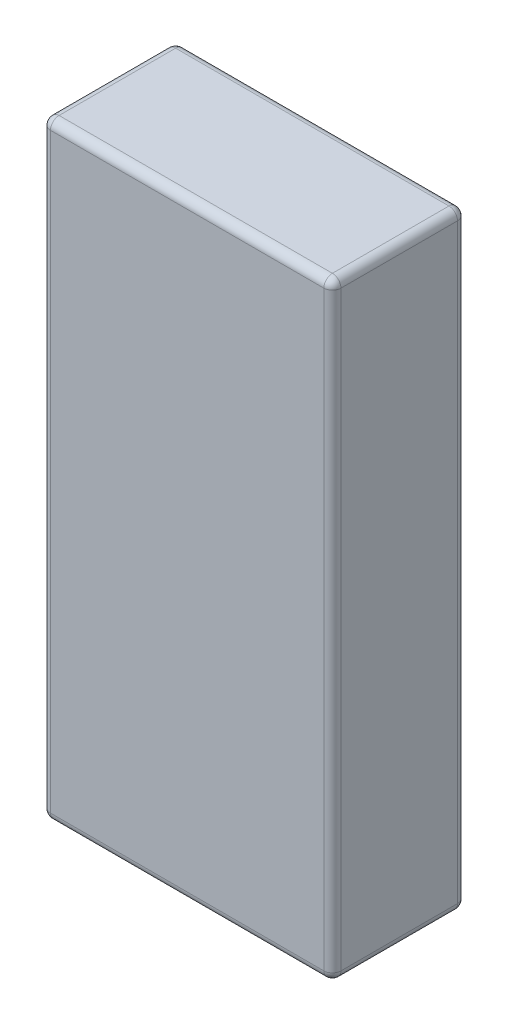
ISO-10303-21;
HEADER;
FILE_DESCRIPTION(('STEP AP214'),'2;1');
FILE_NAME('part.step','',(''),(''),'','','');
FILE_SCHEMA(('AUTOMOTIVE_DESIGN { 1 0 10303 214 1 1 1 1 }'));
ENDSEC;
DATA;
#1=APPLICATION_CONTEXT('core data for automotive mechanical design processes');
#2=APPLICATION_PROTOCOL_DEFINITION('international standard','automotive_design',2000,#1);
#3=PRODUCT_CONTEXT('',#1,'mechanical');
#4=PRODUCT('Part','Part','',(#3));
#5=PRODUCT_RELATED_PRODUCT_CATEGORY('part','',(#4));
#6=PRODUCT_DEFINITION_FORMATION('','',#4);
#7=PRODUCT_DEFINITION_CONTEXT('part definition',#1,'design');
#8=PRODUCT_DEFINITION('design','',#6,#7);
#9=PRODUCT_DEFINITION_SHAPE('','',#8);
#10=(LENGTH_UNIT() NAMED_UNIT(*) SI_UNIT(.MILLI.,.METRE.));
#11=(NAMED_UNIT(*) PLANE_ANGLE_UNIT() SI_UNIT($,.RADIAN.));
#12=(NAMED_UNIT(*) SI_UNIT($,.STERADIAN.) SOLID_ANGLE_UNIT());
#13=UNCERTAINTY_MEASURE_WITH_UNIT(LENGTH_MEASURE(1.E-05),#10,'distance_accuracy_value','');
#14=(GEOMETRIC_REPRESENTATION_CONTEXT(3) GLOBAL_UNCERTAINTY_ASSIGNED_CONTEXT((#13)) GLOBAL_UNIT_ASSIGNED_CONTEXT((#10,
#11,#12)) REPRESENTATION_CONTEXT('',''));
#15=CARTESIAN_POINT('',(0.,0.,0.));
#16=DIRECTION('',(0.,0.,1.));
#17=DIRECTION('',(1.,0.,0.));
#18=AXIS2_PLACEMENT_3D('',#15,#16,#17);
#19=CARTESIAN_POINT('',(16.95,-35.5,7.8));
#20=DIRECTION('',(-1.,0.,0.));
#21=DIRECTION('',(0.,0.,1.));
#22=AXIS2_PLACEMENT_3D('',#19,#20,#21);
#23=PLANE('',#22);
#24=DIRECTION('',(0.,0.,-1.));
#25=VECTOR('',#24,1.);
#26=CARTESIAN_POINT('',(16.95,34.5,7.8));
#27=LINE('',#26,#25);
#28=CARTESIAN_POINT('',(16.95,34.5,-6.8));
#29=VERTEX_POINT('',#28);
#30=CARTESIAN_POINT('',(16.95,34.5,6.8));
#31=VERTEX_POINT('',#30);
#32=EDGE_CURVE('E49',#29,#31,#27,.F.);
#33=ORIENTED_EDGE('',*,*,#32,.T.);
#34=DIRECTION('',(0.,1.,0.));
#35=VECTOR('',#34,1.);
#36=CARTESIAN_POINT('',(16.95,-35.5,6.8));
#37=LINE('',#36,#35);
#38=CARTESIAN_POINT('',(16.95,-34.5,6.8));
#39=VERTEX_POINT('',#38);
#40=EDGE_CURVE('E11',#31,#39,#37,.F.);
#41=ORIENTED_EDGE('',*,*,#40,.T.);
#42=DIRECTION('',(0.,0.,-1.));
#43=VECTOR('',#42,1.);
#44=CARTESIAN_POINT('',(16.95,-34.5,7.8));
#45=LINE('',#44,#43);
#46=CARTESIAN_POINT('',(16.95,-34.5,-6.8));
#47=VERTEX_POINT('',#46);
#48=EDGE_CURVE('E218',#39,#47,#45,.T.);
#49=ORIENTED_EDGE('',*,*,#48,.T.);
#50=DIRECTION('',(0.,1.,0.));
#51=VECTOR('',#50,1.);
#52=CARTESIAN_POINT('',(16.95,34.5,-6.8));
#53=LINE('',#52,#51);
#54=EDGE_CURVE('E60',#47,#29,#53,.T.);
#55=ORIENTED_EDGE('',*,*,#54,.T.);
#56=EDGE_LOOP('',(#33,#41,#49,#55));
#57=FACE_BOUND('',#56,.T.);
#58=ADVANCED_FACE('F40',(#57),#23,.F.);
#59=CARTESIAN_POINT('',(-16.95,35.5,7.8));
#60=DIRECTION('',(0.,-1.,0.));
#61=DIRECTION('',(0.,0.,-1.));
#62=AXIS2_PLACEMENT_3D('',#59,#60,#61);
#63=PLANE('',#62);
#64=DIRECTION('',(-1.,0.,0.));
#65=VECTOR('',#64,1.);
#66=CARTESIAN_POINT('',(-16.95,35.5,-6.8));
#67=LINE('',#66,#65);
#68=CARTESIAN_POINT('',(15.95,35.5,-6.8));
#69=VERTEX_POINT('',#68);
#70=CARTESIAN_POINT('',(-15.95,35.5,-6.8));
#71=VERTEX_POINT('',#70);
#72=EDGE_CURVE('E136',#69,#71,#67,.T.);
#73=ORIENTED_EDGE('',*,*,#72,.T.);
#74=DIRECTION('',(0.,0.,-1.));
#75=VECTOR('',#74,1.);
#76=CARTESIAN_POINT('',(-15.95,35.5,7.8));
#77=LINE('',#76,#75);
#78=CARTESIAN_POINT('',(-15.95,35.5,6.8));
#79=VERTEX_POINT('',#78);
#80=EDGE_CURVE('E130',#71,#79,#77,.F.);
#81=ORIENTED_EDGE('',*,*,#80,.T.);
#82=DIRECTION('',(-1.,0.,0.));
#83=VECTOR('',#82,1.);
#84=CARTESIAN_POINT('',(-16.95,35.5,6.8));
#85=LINE('',#84,#83);
#86=CARTESIAN_POINT('',(15.95,35.5,6.8));
#87=VERTEX_POINT('',#86);
#88=EDGE_CURVE('E133',#79,#87,#85,.F.);
#89=ORIENTED_EDGE('',*,*,#88,.T.);
#90=DIRECTION('',(0.,0.,-1.));
#91=VECTOR('',#90,1.);
#92=CARTESIAN_POINT('',(15.95,35.5,7.8));
#93=LINE('',#92,#91);
#94=EDGE_CURVE('E141',#87,#69,#93,.T.);
#95=ORIENTED_EDGE('',*,*,#94,.T.);
#96=EDGE_LOOP('',(#73,#81,#89,#95));
#97=FACE_BOUND('',#96,.T.);
#98=ADVANCED_FACE('F132',(#97),#63,.F.);
#99=CARTESIAN_POINT('',(-16.95,-35.5,7.8));
#100=DIRECTION('',(1.,0.,0.));
#101=DIRECTION('',(0.,0.,-1.));
#102=AXIS2_PLACEMENT_3D('',#99,#100,#101);
#103=PLANE('',#102);
#104=DIRECTION('',(0.,-1.,0.));
#105=VECTOR('',#104,1.);
#106=CARTESIAN_POINT('',(-16.95,-35.5,6.8));
#107=LINE('',#106,#105);
#108=CARTESIAN_POINT('',(-16.95,-34.5,6.8));
#109=VERTEX_POINT('',#108);
#110=CARTESIAN_POINT('',(-16.95,34.5,6.8));
#111=VERTEX_POINT('',#110);
#112=EDGE_CURVE('E161',#109,#111,#107,.F.);
#113=ORIENTED_EDGE('',*,*,#112,.T.);
#114=DIRECTION('',(0.,0.,-1.));
#115=VECTOR('',#114,1.);
#116=CARTESIAN_POINT('',(-16.95,34.5,7.8));
#117=LINE('',#116,#115);
#118=CARTESIAN_POINT('',(-16.95,34.5,-6.8));
#119=VERTEX_POINT('',#118);
#120=EDGE_CURVE('E166',#111,#119,#117,.T.);
#121=ORIENTED_EDGE('',*,*,#120,.T.);
#122=DIRECTION('',(0.,-1.,0.));
#123=VECTOR('',#122,1.);
#124=CARTESIAN_POINT('',(-16.95,-34.5,-6.8));
#125=LINE('',#124,#123);
#126=CARTESIAN_POINT('',(-16.95,-34.5,-6.8));
#127=VERTEX_POINT('',#126);
#128=EDGE_CURVE('E247',#119,#127,#125,.T.);
#129=ORIENTED_EDGE('',*,*,#128,.T.);
#130=DIRECTION('',(0.,0.,-1.));
#131=VECTOR('',#130,1.);
#132=CARTESIAN_POINT('',(-16.95,-34.5,7.8));
#133=LINE('',#132,#131);
#134=EDGE_CURVE('E249',#127,#109,#133,.F.);
#135=ORIENTED_EDGE('',*,*,#134,.T.);
#136=EDGE_LOOP('',(#113,#121,#129,#135));
#137=FACE_BOUND('',#136,.T.);
#138=ADVANCED_FACE('F293',(#137),#103,.F.);
#139=CARTESIAN_POINT('',(-16.95,-35.5,7.8));
#140=DIRECTION('',(0.,1.,0.));
#141=DIRECTION('',(0.,0.,1.));
#142=AXIS2_PLACEMENT_3D('',#139,#140,#141);
#143=PLANE('',#142);
#144=DIRECTION('',(1.,0.,0.));
#145=VECTOR('',#144,1.);
#146=CARTESIAN_POINT('',(-16.95,-35.5,6.8));
#147=LINE('',#146,#145);
#148=CARTESIAN_POINT('',(15.95,-35.5,6.8));
#149=VERTEX_POINT('',#148);
#150=CARTESIAN_POINT('',(-15.95,-35.5,6.8));
#151=VERTEX_POINT('',#150);
#152=EDGE_CURVE('E190',#149,#151,#147,.F.);
#153=ORIENTED_EDGE('',*,*,#152,.T.);
#154=DIRECTION('',(0.,0.,-1.));
#155=VECTOR('',#154,1.);
#156=CARTESIAN_POINT('',(-15.95,-35.5,7.8));
#157=LINE('',#156,#155);
#158=CARTESIAN_POINT('',(-15.95,-35.5,-6.8));
#159=VERTEX_POINT('',#158);
#160=EDGE_CURVE('E231',#151,#159,#157,.T.);
#161=ORIENTED_EDGE('',*,*,#160,.T.);
#162=DIRECTION('',(1.,0.,0.));
#163=VECTOR('',#162,1.);
#164=CARTESIAN_POINT('',(16.95,-35.5,-6.8));
#165=LINE('',#164,#163);
#166=CARTESIAN_POINT('',(15.95,-35.5,-6.8));
#167=VERTEX_POINT('',#166);
#168=EDGE_CURVE('E265',#159,#167,#165,.T.);
#169=ORIENTED_EDGE('',*,*,#168,.T.);
#170=DIRECTION('',(0.,0.,-1.));
#171=VECTOR('',#170,1.);
#172=CARTESIAN_POINT('',(15.95,-35.5,7.8));
#173=LINE('',#172,#171);
#174=EDGE_CURVE('E233',#167,#149,#173,.F.);
#175=ORIENTED_EDGE('',*,*,#174,.T.);
#176=EDGE_LOOP('',(#153,#161,#169,#175));
#177=FACE_BOUND('',#176,.T.);
#178=ADVANCED_FACE('F275',(#177),#143,.F.);
#179=CARTESIAN_POINT('',(0.,0.,7.8));
#180=DIRECTION('',(0.,0.,-1.));
#181=DIRECTION('',(-1.,0.,0.));
#182=AXIS2_PLACEMENT_3D('',#179,#180,#181);
#183=PLANE('',#182);
#184=DIRECTION('',(1.,0.,0.));
#185=VECTOR('',#184,1.);
#186=CARTESIAN_POINT('',(0.,-34.5,7.8));
#187=LINE('',#186,#185);
#188=CARTESIAN_POINT('',(-15.95,-34.5,7.8));
#189=VERTEX_POINT('',#188);
#190=CARTESIAN_POINT('',(15.95,-34.5,7.8));
#191=VERTEX_POINT('',#190);
#192=EDGE_CURVE('E152',#189,#191,#187,.T.);
#193=ORIENTED_EDGE('',*,*,#192,.T.);
#194=DIRECTION('',(0.,1.,0.));
#195=VECTOR('',#194,1.);
#196=CARTESIAN_POINT('',(15.95,0.,7.8));
#197=LINE('',#196,#195);
#198=CARTESIAN_POINT('',(15.95,34.5,7.8));
#199=VERTEX_POINT('',#198);
#200=EDGE_CURVE('E222',#191,#199,#197,.T.);
#201=ORIENTED_EDGE('',*,*,#200,.T.);
#202=DIRECTION('',(-1.,0.,0.));
#203=VECTOR('',#202,1.);
#204=CARTESIAN_POINT('',(0.,34.5,7.8));
#205=LINE('',#204,#203);
#206=CARTESIAN_POINT('',(-15.95,34.5,7.8));
#207=VERTEX_POINT('',#206);
#208=EDGE_CURVE('E256',#199,#207,#205,.T.);
#209=ORIENTED_EDGE('',*,*,#208,.T.);
#210=DIRECTION('',(0.,-1.,0.));
#211=VECTOR('',#210,1.);
#212=CARTESIAN_POINT('',(-15.95,0.,7.8));
#213=LINE('',#212,#211);
#214=EDGE_CURVE('E224',#207,#189,#213,.T.);
#215=ORIENTED_EDGE('',*,*,#214,.T.);
#216=EDGE_LOOP('',(#193,#201,#209,#215));
#217=FACE_BOUND('',#216,.T.);
#218=ADVANCED_FACE('F504',(#217),#183,.F.);
#219=CARTESIAN_POINT('',(0.,0.,-7.8));
#220=DIRECTION('',(0.,0.,-1.));
#221=DIRECTION('',(-1.,0.,0.));
#222=AXIS2_PLACEMENT_3D('',#219,#220,#221);
#223=PLANE('',#222);
#224=DIRECTION('',(1.,0.,0.));
#225=VECTOR('',#224,1.);
#226=CARTESIAN_POINT('',(-16.95,-34.5,-7.8));
#227=LINE('',#226,#225);
#228=CARTESIAN_POINT('',(15.95,-34.5,-7.8));
#229=VERTEX_POINT('',#228);
#230=CARTESIAN_POINT('',(-15.95,-34.5,-7.8));
#231=VERTEX_POINT('',#230);
#232=EDGE_CURVE('E258',#229,#231,#227,.F.);
#233=ORIENTED_EDGE('',*,*,#232,.T.);
#234=DIRECTION('',(0.,-1.,0.));
#235=VECTOR('',#234,1.);
#236=CARTESIAN_POINT('',(-15.95,34.5,-7.8));
#237=LINE('',#236,#235);
#238=CARTESIAN_POINT('',(-15.95,34.5,-7.8));
#239=VERTEX_POINT('',#238);
#240=EDGE_CURVE('E239',#231,#239,#237,.F.);
#241=ORIENTED_EDGE('',*,*,#240,.T.);
#242=DIRECTION('',(-1.,0.,0.));
#243=VECTOR('',#242,1.);
#244=CARTESIAN_POINT('',(16.95,34.5,-7.8));
#245=LINE('',#244,#243);
#246=CARTESIAN_POINT('',(15.95,34.5,-7.8));
#247=VERTEX_POINT('',#246);
#248=EDGE_CURVE('E261',#239,#247,#245,.F.);
#249=ORIENTED_EDGE('',*,*,#248,.T.);
#250=DIRECTION('',(0.,1.,0.));
#251=VECTOR('',#250,1.);
#252=CARTESIAN_POINT('',(15.95,-34.5,-7.8));
#253=LINE('',#252,#251);
#254=EDGE_CURVE('E212',#247,#229,#253,.F.);
#255=ORIENTED_EDGE('',*,*,#254,.T.);
#256=EDGE_LOOP('',(#233,#241,#249,#255));
#257=FACE_BOUND('',#256,.T.);
#258=ADVANCED_FACE('F307',(#257),#223,.T.);
#259=CARTESIAN_POINT('',(-16.95,-34.5,-6.8));
#260=DIRECTION('',(-1.,0.,0.));
#261=DIRECTION('',(0.,0.,1.));
#262=AXIS2_PLACEMENT_3D('',#259,#260,#261);
#263=CYLINDRICAL_SURFACE('',#262,1.);
#264=ORIENTED_EDGE('',*,*,#168,.F.);
#265=CARTESIAN_POINT('',(-15.95,-34.5,-6.8));
#266=DIRECTION('',(-1.,0.,0.));
#267=DIRECTION('',(0.,0.,1.));
#268=AXIS2_PLACEMENT_3D('',#265,#266,#267);
#269=CIRCLE('',#268,1.);
#270=EDGE_CURVE('E235',#159,#231,#269,.F.);
#271=ORIENTED_EDGE('',*,*,#270,.T.);
#272=ORIENTED_EDGE('',*,*,#232,.F.);
#273=CARTESIAN_POINT('',(15.95,-34.5,-6.8));
#274=DIRECTION('',(-1.,0.,0.));
#275=DIRECTION('',(0.,0.,1.));
#276=AXIS2_PLACEMENT_3D('',#273,#274,#275);
#277=CIRCLE('',#276,1.);
#278=EDGE_CURVE('E237',#229,#167,#277,.T.);
#279=ORIENTED_EDGE('',*,*,#278,.T.);
#280=EDGE_LOOP('',(#264,#271,#272,#279));
#281=FACE_BOUND('',#280,.T.);
#282=ADVANCED_FACE('F305',(#281),#263,.T.);
#283=CARTESIAN_POINT('',(0.,-34.5,6.8));
#284=DIRECTION('',(1.,0.,0.));
#285=DIRECTION('',(0.,0.,-1.));
#286=AXIS2_PLACEMENT_3D('',#283,#284,#285);
#287=CYLINDRICAL_SURFACE('',#286,1.);
#288=ORIENTED_EDGE('',*,*,#192,.F.);
#289=CARTESIAN_POINT('',(-15.95,-34.5,6.8));
#290=DIRECTION('',(1.,0.,0.));
#291=DIRECTION('',(0.,0.,-1.));
#292=AXIS2_PLACEMENT_3D('',#289,#290,#291);
#293=CIRCLE('',#292,1.);
#294=EDGE_CURVE('E226',#189,#151,#293,.T.);
#295=ORIENTED_EDGE('',*,*,#294,.T.);
#296=ORIENTED_EDGE('',*,*,#152,.F.);
#297=CARTESIAN_POINT('',(15.95,-34.5,6.8));
#298=DIRECTION('',(1.,0.,0.));
#299=DIRECTION('',(0.,0.,-1.));
#300=AXIS2_PLACEMENT_3D('',#297,#298,#299);
#301=CIRCLE('',#300,1.);
#302=EDGE_CURVE('E228',#149,#191,#301,.F.);
#303=ORIENTED_EDGE('',*,*,#302,.T.);
#304=EDGE_LOOP('',(#288,#295,#296,#303));
#305=FACE_BOUND('',#304,.T.);
#306=ADVANCED_FACE('F332',(#305),#287,.T.);
#307=CARTESIAN_POINT('',(-16.95,34.5,-6.8));
#308=DIRECTION('',(1.,0.,0.));
#309=DIRECTION('',(0.,0.,-1.));
#310=AXIS2_PLACEMENT_3D('',#307,#308,#309);
#311=CYLINDRICAL_SURFACE('',#310,1.);
#312=ORIENTED_EDGE('',*,*,#248,.F.);
#313=CARTESIAN_POINT('',(-15.95,34.5,-6.8));
#314=DIRECTION('',(1.,0.,0.));
#315=DIRECTION('',(0.,0.,-1.));
#316=AXIS2_PLACEMENT_3D('',#313,#314,#315);
#317=CIRCLE('',#316,1.);
#318=EDGE_CURVE('E242',#239,#71,#317,.T.);
#319=ORIENTED_EDGE('',*,*,#318,.T.);
#320=ORIENTED_EDGE('',*,*,#72,.F.);
#321=CARTESIAN_POINT('',(15.95,34.5,-6.8));
#322=DIRECTION('',(1.,0.,0.));
#323=DIRECTION('',(0.,0.,-1.));
#324=AXIS2_PLACEMENT_3D('',#321,#322,#323);
#325=CIRCLE('',#324,1.);
#326=EDGE_CURVE('E140',#69,#247,#325,.F.);
#327=ORIENTED_EDGE('',*,*,#326,.T.);
#328=EDGE_LOOP('',(#312,#319,#320,#327));
#329=FACE_BOUND('',#328,.T.);
#330=ADVANCED_FACE('F310',(#329),#311,.T.);
#331=CARTESIAN_POINT('',(0.,34.5,6.8));
#332=DIRECTION('',(-1.,0.,0.));
#333=DIRECTION('',(0.,0.,1.));
#334=AXIS2_PLACEMENT_3D('',#331,#332,#333);
#335=CYLINDRICAL_SURFACE('',#334,1.);
#336=ORIENTED_EDGE('',*,*,#88,.F.);
#337=CARTESIAN_POINT('',(-15.95,34.5,6.8));
#338=DIRECTION('',(-1.,0.,0.));
#339=DIRECTION('',(0.,0.,1.));
#340=AXIS2_PLACEMENT_3D('',#337,#338,#339);
#341=CIRCLE('',#340,1.);
#342=EDGE_CURVE('E148',#79,#207,#341,.F.);
#343=ORIENTED_EDGE('',*,*,#342,.T.);
#344=ORIENTED_EDGE('',*,*,#208,.F.);
#345=CARTESIAN_POINT('',(15.95,34.5,6.8));
#346=DIRECTION('',(-1.,0.,0.));
#347=DIRECTION('',(0.,0.,1.));
#348=AXIS2_PLACEMENT_3D('',#345,#346,#347);
#349=CIRCLE('',#348,1.);
#350=EDGE_CURVE('E151',#199,#87,#349,.T.);
#351=ORIENTED_EDGE('',*,*,#350,.T.);
#352=EDGE_LOOP('',(#336,#343,#344,#351));
#353=FACE_BOUND('',#352,.T.);
#354=ADVANCED_FACE('F146',(#353),#335,.T.);
#355=CARTESIAN_POINT('',(-15.95,-34.5,-6.8));
#356=DIRECTION('',(0.,0.,1.));
#357=DIRECTION('',(1.,0.,0.));
#358=AXIS2_PLACEMENT_3D('',#355,#356,#357);
#359=SPHERICAL_SURFACE('',#358,1.);
#360=CARTESIAN_POINT('',(-15.95,-34.5,-6.8));
#361=DIRECTION('',(0.,1.,0.));
#362=DIRECTION('',(0.,0.,1.));
#363=AXIS2_PLACEMENT_3D('',#360,#361,#362);
#364=CIRCLE('',#363,1.);
#365=EDGE_CURVE('E184',#231,#127,#364,.T.);
#366=ORIENTED_EDGE('',*,*,#365,.F.);
#367=ORIENTED_EDGE('',*,*,#270,.F.);
#368=CARTESIAN_POINT('',(-15.95,-34.5,-6.8));
#369=DIRECTION('',(0.,0.,1.));
#370=DIRECTION('',(1.,0.,0.));
#371=AXIS2_PLACEMENT_3D('',#368,#369,#370);
#372=CIRCLE('',#371,1.);
#373=EDGE_CURVE('E187',#127,#159,#372,.T.);
#374=ORIENTED_EDGE('',*,*,#373,.F.);
#375=EDGE_LOOP('',(#366,#367,#374));
#376=FACE_BOUND('',#375,.T.);
#377=ADVANCED_FACE('F302',(#376),#359,.T.);
#378=CARTESIAN_POINT('',(-15.95,-34.5,7.8));
#379=DIRECTION('',(0.,0.,-1.));
#380=DIRECTION('',(-1.,0.,0.));
#381=AXIS2_PLACEMENT_3D('',#378,#379,#380);
#382=CYLINDRICAL_SURFACE('',#381,1.);
#383=ORIENTED_EDGE('',*,*,#373,.T.);
#384=ORIENTED_EDGE('',*,*,#160,.F.);
#385=CARTESIAN_POINT('',(-15.95,-34.5,6.8));
#386=DIRECTION('',(0.,0.,1.));
#387=DIRECTION('',(1.,0.,0.));
#388=AXIS2_PLACEMENT_3D('',#385,#386,#387);
#389=CIRCLE('',#388,1.);
#390=EDGE_CURVE('E181',#109,#151,#389,.T.);
#391=ORIENTED_EDGE('',*,*,#390,.F.);
#392=ORIENTED_EDGE('',*,*,#134,.F.);
#393=EDGE_LOOP('',(#383,#384,#391,#392));
#394=FACE_BOUND('',#393,.T.);
#395=ADVANCED_FACE('F282',(#394),#382,.T.);
#396=CARTESIAN_POINT('',(-15.95,-35.5,-6.8));
#397=DIRECTION('',(0.,1.,0.));
#398=DIRECTION('',(0.,0.,1.));
#399=AXIS2_PLACEMENT_3D('',#396,#397,#398);
#400=CYLINDRICAL_SURFACE('',#399,1.);
#401=ORIENTED_EDGE('',*,*,#365,.T.);
#402=ORIENTED_EDGE('',*,*,#128,.F.);
#403=CARTESIAN_POINT('',(-15.95,34.5,-6.8));
#404=DIRECTION('',(0.,1.,0.));
#405=DIRECTION('',(0.,0.,1.));
#406=AXIS2_PLACEMENT_3D('',#403,#404,#405);
#407=CIRCLE('',#406,1.);
#408=EDGE_CURVE('E178',#239,#119,#407,.T.);
#409=ORIENTED_EDGE('',*,*,#408,.F.);
#410=ORIENTED_EDGE('',*,*,#240,.F.);
#411=EDGE_LOOP('',(#401,#402,#409,#410));
#412=FACE_BOUND('',#411,.T.);
#413=ADVANCED_FACE('F299',(#412),#400,.T.);
#414=CARTESIAN_POINT('',(-15.95,-34.5,6.8));
#415=DIRECTION('',(0.,0.,1.));
#416=DIRECTION('',(1.,0.,0.));
#417=AXIS2_PLACEMENT_3D('',#414,#415,#416);
#418=SPHERICAL_SURFACE('',#417,1.);
#419=ORIENTED_EDGE('',*,*,#390,.T.);
#420=ORIENTED_EDGE('',*,*,#294,.F.);
#421=CARTESIAN_POINT('',(-15.95,-34.5,6.8));
#422=DIRECTION('',(0.,1.,0.));
#423=DIRECTION('',(0.,0.,1.));
#424=AXIS2_PLACEMENT_3D('',#421,#422,#423);
#425=CIRCLE('',#424,1.);
#426=EDGE_CURVE('E175',#109,#189,#425,.T.);
#427=ORIENTED_EDGE('',*,*,#426,.F.);
#428=EDGE_LOOP('',(#419,#420,#427));
#429=FACE_BOUND('',#428,.T.);
#430=ADVANCED_FACE('F288',(#429),#418,.T.);
#431=CARTESIAN_POINT('',(-15.95,34.5,-6.8));
#432=DIRECTION('',(0.,0.,1.));
#433=DIRECTION('',(1.,0.,0.));
#434=AXIS2_PLACEMENT_3D('',#431,#432,#433);
#435=SPHERICAL_SURFACE('',#434,1.);
#436=ORIENTED_EDGE('',*,*,#318,.F.);
#437=ORIENTED_EDGE('',*,*,#408,.T.);
#438=CARTESIAN_POINT('',(-15.95,34.5,-6.8));
#439=DIRECTION('',(0.,0.,1.));
#440=DIRECTION('',(1.,0.,0.));
#441=AXIS2_PLACEMENT_3D('',#438,#439,#440);
#442=CIRCLE('',#441,1.);
#443=EDGE_CURVE('E168',#71,#119,#442,.T.);
#444=ORIENTED_EDGE('',*,*,#443,.F.);
#445=EDGE_LOOP('',(#436,#437,#444));
#446=FACE_BOUND('',#445,.T.);
#447=ADVANCED_FACE('F313',(#446),#435,.T.);
#448=CARTESIAN_POINT('',(-15.95,0.,6.8));
#449=DIRECTION('',(0.,-1.,0.));
#450=DIRECTION('',(0.,0.,-1.));
#451=AXIS2_PLACEMENT_3D('',#448,#449,#450);
#452=CYLINDRICAL_SURFACE('',#451,1.);
#453=ORIENTED_EDGE('',*,*,#426,.T.);
#454=ORIENTED_EDGE('',*,*,#214,.F.);
#455=CARTESIAN_POINT('',(-15.95,34.5,6.8));
#456=DIRECTION('',(0.,1.,0.));
#457=DIRECTION('',(0.,0.,1.));
#458=AXIS2_PLACEMENT_3D('',#455,#456,#457);
#459=CIRCLE('',#458,1.);
#460=EDGE_CURVE('E159',#111,#207,#459,.T.);
#461=ORIENTED_EDGE('',*,*,#460,.F.);
#462=ORIENTED_EDGE('',*,*,#112,.F.);
#463=EDGE_LOOP('',(#453,#454,#461,#462));
#464=FACE_BOUND('',#463,.T.);
#465=ADVANCED_FACE('F291',(#464),#452,.T.);
#466=CARTESIAN_POINT('',(-15.95,34.5,7.8));
#467=DIRECTION('',(0.,0.,-1.));
#468=DIRECTION('',(-1.,0.,0.));
#469=AXIS2_PLACEMENT_3D('',#466,#467,#468);
#470=CYLINDRICAL_SURFACE('',#469,1.);
#471=ORIENTED_EDGE('',*,*,#443,.T.);
#472=ORIENTED_EDGE('',*,*,#120,.F.);
#473=CARTESIAN_POINT('',(-15.95,34.5,6.8));
#474=DIRECTION('',(0.,0.,1.));
#475=DIRECTION('',(1.,0.,0.));
#476=AXIS2_PLACEMENT_3D('',#473,#474,#475);
#477=CIRCLE('',#476,1.);
#478=EDGE_CURVE('E157',#79,#111,#477,.T.);
#479=ORIENTED_EDGE('',*,*,#478,.F.);
#480=ORIENTED_EDGE('',*,*,#80,.F.);
#481=EDGE_LOOP('',(#471,#472,#479,#480));
#482=FACE_BOUND('',#481,.T.);
#483=ADVANCED_FACE('F164',(#482),#470,.T.);
#484=CARTESIAN_POINT('',(-15.95,34.5,6.8));
#485=DIRECTION('',(0.,0.,1.));
#486=DIRECTION('',(1.,0.,0.));
#487=AXIS2_PLACEMENT_3D('',#484,#485,#486);
#488=SPHERICAL_SURFACE('',#487,1.);
#489=ORIENTED_EDGE('',*,*,#460,.T.);
#490=ORIENTED_EDGE('',*,*,#342,.F.);
#491=ORIENTED_EDGE('',*,*,#478,.T.);
#492=EDGE_LOOP('',(#489,#490,#491));
#493=FACE_BOUND('',#492,.T.);
#494=ADVANCED_FACE('F156',(#493),#488,.T.);
#495=CARTESIAN_POINT('',(15.95,34.5,-6.8));
#496=DIRECTION('',(0.,0.,1.));
#497=DIRECTION('',(1.,0.,0.));
#498=AXIS2_PLACEMENT_3D('',#495,#496,#497);
#499=SPHERICAL_SURFACE('',#498,1.);
#500=CARTESIAN_POINT('',(15.95,34.5,-6.8));
#501=DIRECTION('',(0.,-1.,0.));
#502=DIRECTION('',(0.,0.,-1.));
#503=AXIS2_PLACEMENT_3D('',#500,#501,#502);
#504=CIRCLE('',#503,1.);
#505=EDGE_CURVE('E171',#247,#29,#504,.T.);
#506=ORIENTED_EDGE('',*,*,#505,.F.);
#507=ORIENTED_EDGE('',*,*,#326,.F.);
#508=CARTESIAN_POINT('',(15.95,34.5,-6.8));
#509=DIRECTION('',(0.,0.,1.));
#510=DIRECTION('',(1.,0.,0.));
#511=AXIS2_PLACEMENT_3D('',#508,#509,#510);
#512=CIRCLE('',#511,1.);
#513=EDGE_CURVE('E44',#29,#69,#512,.T.);
#514=ORIENTED_EDGE('',*,*,#513,.F.);
#515=EDGE_LOOP('',(#506,#507,#514));
#516=FACE_BOUND('',#515,.T.);
#517=ADVANCED_FACE('F42',(#516),#499,.T.);
#518=CARTESIAN_POINT('',(15.95,34.5,7.8));
#519=DIRECTION('',(0.,0.,-1.));
#520=DIRECTION('',(-1.,0.,0.));
#521=AXIS2_PLACEMENT_3D('',#518,#519,#520);
#522=CYLINDRICAL_SURFACE('',#521,1.);
#523=ORIENTED_EDGE('',*,*,#513,.T.);
#524=ORIENTED_EDGE('',*,*,#94,.F.);
#525=CARTESIAN_POINT('',(15.95,34.5,6.8));
#526=DIRECTION('',(0.,0.,1.));
#527=DIRECTION('',(1.,0.,0.));
#528=AXIS2_PLACEMENT_3D('',#525,#526,#527);
#529=CIRCLE('',#528,1.);
#530=EDGE_CURVE('E204',#31,#87,#529,.T.);
#531=ORIENTED_EDGE('',*,*,#530,.F.);
#532=ORIENTED_EDGE('',*,*,#32,.F.);
#533=EDGE_LOOP('',(#523,#524,#531,#532));
#534=FACE_BOUND('',#533,.T.);
#535=ADVANCED_FACE('F216',(#534),#522,.T.);
#536=CARTESIAN_POINT('',(15.95,-35.5,-6.8));
#537=DIRECTION('',(0.,-1.,0.));
#538=DIRECTION('',(0.,0.,-1.));
#539=AXIS2_PLACEMENT_3D('',#536,#537,#538);
#540=CYLINDRICAL_SURFACE('',#539,1.);
#541=ORIENTED_EDGE('',*,*,#505,.T.);
#542=ORIENTED_EDGE('',*,*,#54,.F.);
#543=CARTESIAN_POINT('',(15.95,-34.5,-6.8));
#544=DIRECTION('',(0.,-1.,0.));
#545=DIRECTION('',(0.,0.,-1.));
#546=AXIS2_PLACEMENT_3D('',#543,#544,#545);
#547=CIRCLE('',#546,1.);
#548=EDGE_CURVE('E201',#229,#47,#547,.T.);
#549=ORIENTED_EDGE('',*,*,#548,.F.);
#550=ORIENTED_EDGE('',*,*,#254,.F.);
#551=EDGE_LOOP('',(#541,#542,#549,#550));
#552=FACE_BOUND('',#551,.T.);
#553=ADVANCED_FACE('F210',(#552),#540,.T.);
#554=CARTESIAN_POINT('',(15.95,34.5,6.8));
#555=DIRECTION('',(0.,0.,1.));
#556=DIRECTION('',(1.,0.,0.));
#557=AXIS2_PLACEMENT_3D('',#554,#555,#556);
#558=SPHERICAL_SURFACE('',#557,1.);
#559=ORIENTED_EDGE('',*,*,#530,.T.);
#560=ORIENTED_EDGE('',*,*,#350,.F.);
#561=CARTESIAN_POINT('',(15.95,34.5,6.8));
#562=DIRECTION('',(0.,-1.,0.));
#563=DIRECTION('',(0.,0.,-1.));
#564=AXIS2_PLACEMENT_3D('',#561,#562,#563);
#565=CIRCLE('',#564,1.);
#566=EDGE_CURVE('E198',#31,#199,#565,.T.);
#567=ORIENTED_EDGE('',*,*,#566,.F.);
#568=EDGE_LOOP('',(#559,#560,#567));
#569=FACE_BOUND('',#568,.T.);
#570=ADVANCED_FACE('F366',(#569),#558,.T.);
#571=CARTESIAN_POINT('',(15.95,-34.5,-6.8));
#572=DIRECTION('',(0.,0.,1.));
#573=DIRECTION('',(1.,0.,0.));
#574=AXIS2_PLACEMENT_3D('',#571,#572,#573);
#575=SPHERICAL_SURFACE('',#574,1.);
#576=ORIENTED_EDGE('',*,*,#278,.F.);
#577=ORIENTED_EDGE('',*,*,#548,.T.);
#578=CARTESIAN_POINT('',(15.95,-34.5,-6.8));
#579=DIRECTION('',(0.,0.,1.));
#580=DIRECTION('',(1.,0.,0.));
#581=AXIS2_PLACEMENT_3D('',#578,#579,#580);
#582=CIRCLE('',#581,1.);
#583=EDGE_CURVE('E195',#167,#47,#582,.T.);
#584=ORIENTED_EDGE('',*,*,#583,.F.);
#585=EDGE_LOOP('',(#576,#577,#584));
#586=FACE_BOUND('',#585,.T.);
#587=ADVANCED_FACE('F373',(#586),#575,.T.);
#588=CARTESIAN_POINT('',(15.95,0.,6.8));
#589=DIRECTION('',(0.,1.,0.));
#590=DIRECTION('',(0.,0.,1.));
#591=AXIS2_PLACEMENT_3D('',#588,#589,#590);
#592=CYLINDRICAL_SURFACE('',#591,1.);
#593=ORIENTED_EDGE('',*,*,#566,.T.);
#594=ORIENTED_EDGE('',*,*,#200,.F.);
#595=CARTESIAN_POINT('',(15.95,-34.5,6.8));
#596=DIRECTION('',(0.,-1.,0.));
#597=DIRECTION('',(0.,0.,-1.));
#598=AXIS2_PLACEMENT_3D('',#595,#596,#597);
#599=CIRCLE('',#598,1.);
#600=EDGE_CURVE('E193',#39,#191,#599,.T.);
#601=ORIENTED_EDGE('',*,*,#600,.F.);
#602=ORIENTED_EDGE('',*,*,#40,.F.);
#603=EDGE_LOOP('',(#593,#594,#601,#602));
#604=FACE_BOUND('',#603,.T.);
#605=ADVANCED_FACE('F381',(#604),#592,.T.);
#606=CARTESIAN_POINT('',(15.95,-34.5,7.8));
#607=DIRECTION('',(0.,0.,-1.));
#608=DIRECTION('',(-1.,0.,0.));
#609=AXIS2_PLACEMENT_3D('',#606,#607,#608);
#610=CYLINDRICAL_SURFACE('',#609,1.);
#611=ORIENTED_EDGE('',*,*,#583,.T.);
#612=ORIENTED_EDGE('',*,*,#48,.F.);
#613=CARTESIAN_POINT('',(15.95,-34.5,6.8));
#614=DIRECTION('',(0.,0.,1.));
#615=DIRECTION('',(1.,0.,0.));
#616=AXIS2_PLACEMENT_3D('',#613,#614,#615);
#617=CIRCLE('',#616,1.);
#618=EDGE_CURVE('E191',#149,#39,#617,.T.);
#619=ORIENTED_EDGE('',*,*,#618,.F.);
#620=ORIENTED_EDGE('',*,*,#174,.F.);
#621=EDGE_LOOP('',(#611,#612,#619,#620));
#622=FACE_BOUND('',#621,.T.);
#623=ADVANCED_FACE('F389',(#622),#610,.T.);
#624=CARTESIAN_POINT('',(15.95,-34.5,6.8));
#625=DIRECTION('',(0.,0.,1.));
#626=DIRECTION('',(1.,0.,0.));
#627=AXIS2_PLACEMENT_3D('',#624,#625,#626);
#628=SPHERICAL_SURFACE('',#627,1.);
#629=ORIENTED_EDGE('',*,*,#600,.T.);
#630=ORIENTED_EDGE('',*,*,#302,.F.);
#631=ORIENTED_EDGE('',*,*,#618,.T.);
#632=EDGE_LOOP('',(#629,#630,#631));
#633=FACE_BOUND('',#632,.T.);
#634=ADVANCED_FACE('F397',(#633),#628,.T.);
#635=CLOSED_SHELL('',(#58,#98,#138,#178,#218,#258,#282,#306,#330,#354,#377,#395,#413,#430,#447,
#465,#483,#494,#517,#535,#553,#570,#587,#605,#623,#634));
#636=MANIFOLD_SOLID_BREP('B2',#635);
#637=ADVANCED_BREP_SHAPE_REPRESENTATION('',(#18,#636),#14);
#638=SHAPE_DEFINITION_REPRESENTATION(#9,#637);
ENDSEC;
END-ISO-10303-21;
